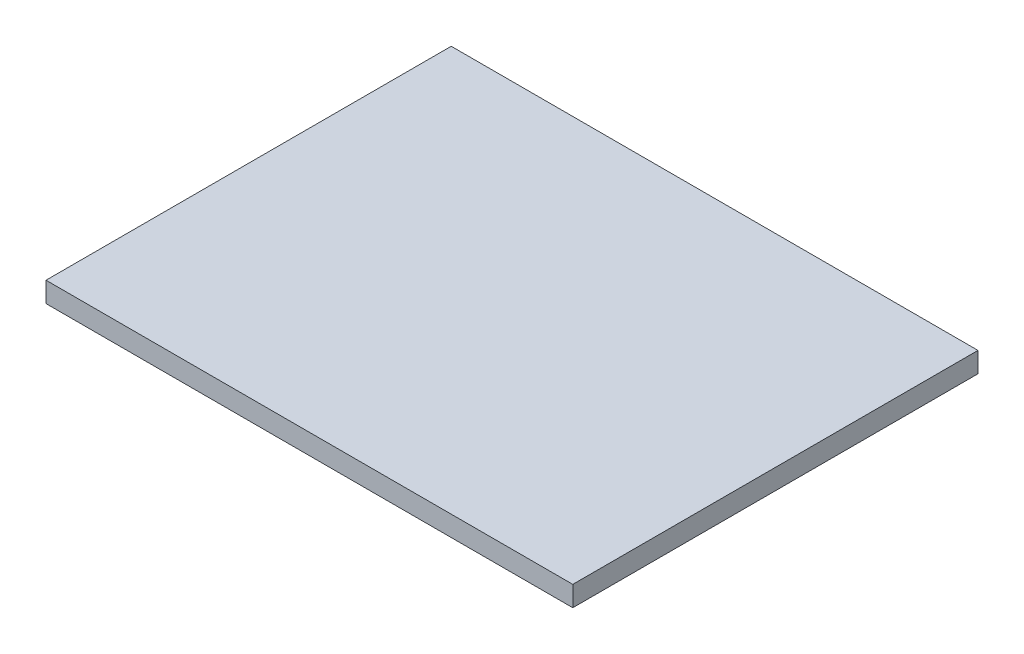
ISO-10303-21;
HEADER;
FILE_DESCRIPTION(('STEP AP214'),'2;1');
FILE_NAME('part.step','',(''),(''),'','','');
FILE_SCHEMA(('AUTOMOTIVE_DESIGN { 1 0 10303 214 1 1 1 1 }'));
ENDSEC;
DATA;
#1=APPLICATION_CONTEXT('core data for automotive mechanical design processes');
#2=APPLICATION_PROTOCOL_DEFINITION('international standard','automotive_design',2000,#1);
#3=PRODUCT_CONTEXT('',#1,'mechanical');
#4=PRODUCT('Part','Part','',(#3));
#5=PRODUCT_RELATED_PRODUCT_CATEGORY('part','',(#4));
#6=PRODUCT_DEFINITION_FORMATION('','',#4);
#7=PRODUCT_DEFINITION_CONTEXT('part definition',#1,'design');
#8=PRODUCT_DEFINITION('design','',#6,#7);
#9=PRODUCT_DEFINITION_SHAPE('','',#8);
#10=(LENGTH_UNIT() NAMED_UNIT(*) SI_UNIT(.MILLI.,.METRE.));
#11=(NAMED_UNIT(*) PLANE_ANGLE_UNIT() SI_UNIT($,.RADIAN.));
#12=(NAMED_UNIT(*) SI_UNIT($,.STERADIAN.) SOLID_ANGLE_UNIT());
#13=UNCERTAINTY_MEASURE_WITH_UNIT(LENGTH_MEASURE(1.E-05),#10,'distance_accuracy_value','');
#14=(GEOMETRIC_REPRESENTATION_CONTEXT(3) GLOBAL_UNCERTAINTY_ASSIGNED_CONTEXT((#13)) GLOBAL_UNIT_ASSIGNED_CONTEXT((#10,
#11,#12)) REPRESENTATION_CONTEXT('',''));
#15=CARTESIAN_POINT('',(0.,0.,0.));
#16=DIRECTION('',(0.,0.,1.));
#17=DIRECTION('',(1.,0.,0.));
#18=AXIS2_PLACEMENT_3D('',#15,#16,#17);
#19=CARTESIAN_POINT('',(60.,5.,45.));
#20=DIRECTION('',(-1.,0.,0.));
#21=DIRECTION('',(0.,0.,1.));
#22=AXIS2_PLACEMENT_3D('',#19,#20,#21);
#23=PLANE('',#22);
#24=DIRECTION('',(0.,0.,-1.));
#25=VECTOR('',#24,1.);
#26=CARTESIAN_POINT('',(60.,0.,45.));
#27=LINE('',#26,#25);
#28=CARTESIAN_POINT('',(60.,0.,45.));
#29=VERTEX_POINT('',#28);
#30=CARTESIAN_POINT('',(60.,0.,-45.));
#31=VERTEX_POINT('',#30);
#32=EDGE_CURVE('E131',#29,#31,#27,.T.);
#33=ORIENTED_EDGE('',*,*,#32,.T.);
#34=DIRECTION('',(0.,-1.,0.));
#35=VECTOR('',#34,1.);
#36=CARTESIAN_POINT('',(60.,5.,-45.));
#37=LINE('',#36,#35);
#38=CARTESIAN_POINT('',(60.,5.,-45.));
#39=VERTEX_POINT('',#38);
#40=EDGE_CURVE('E11',#39,#31,#37,.T.);
#41=ORIENTED_EDGE('',*,*,#40,.F.);
#42=DIRECTION('',(0.,0.,-1.));
#43=VECTOR('',#42,1.);
#44=CARTESIAN_POINT('',(60.,5.,45.));
#45=LINE('',#44,#43);
#46=CARTESIAN_POINT('',(60.,5.,45.));
#47=VERTEX_POINT('',#46);
#48=EDGE_CURVE('E140',#47,#39,#45,.T.);
#49=ORIENTED_EDGE('',*,*,#48,.F.);
#50=DIRECTION('',(0.,-1.,0.));
#51=VECTOR('',#50,1.);
#52=CARTESIAN_POINT('',(60.,5.,45.));
#53=LINE('',#52,#51);
#54=EDGE_CURVE('E149',#47,#29,#53,.T.);
#55=ORIENTED_EDGE('',*,*,#54,.T.);
#56=EDGE_LOOP('',(#33,#41,#49,#55));
#57=FACE_BOUND('',#56,.T.);
#58=ADVANCED_FACE('F33',(#57),#23,.F.);
#59=CARTESIAN_POINT('',(-60.,5.,-45.));
#60=DIRECTION('',(0.,0.,1.));
#61=DIRECTION('',(1.,0.,0.));
#62=AXIS2_PLACEMENT_3D('',#59,#60,#61);
#63=PLANE('',#62);
#64=DIRECTION('',(-1.,0.,0.));
#65=VECTOR('',#64,1.);
#66=CARTESIAN_POINT('',(-60.,0.,-45.));
#67=LINE('',#66,#65);
#68=CARTESIAN_POINT('',(-60.,0.,-45.));
#69=VERTEX_POINT('',#68);
#70=EDGE_CURVE('E134',#31,#69,#67,.T.);
#71=ORIENTED_EDGE('',*,*,#70,.T.);
#72=DIRECTION('',(0.,-1.,0.));
#73=VECTOR('',#72,1.);
#74=CARTESIAN_POINT('',(-60.,5.,-45.));
#75=LINE('',#74,#73);
#76=CARTESIAN_POINT('',(-60.,5.,-45.));
#77=VERTEX_POINT('',#76);
#78=EDGE_CURVE('E41',#77,#69,#75,.T.);
#79=ORIENTED_EDGE('',*,*,#78,.F.);
#80=DIRECTION('',(-1.,0.,0.));
#81=VECTOR('',#80,1.);
#82=CARTESIAN_POINT('',(-60.,5.,-45.));
#83=LINE('',#82,#81);
#84=EDGE_CURVE('E75',#39,#77,#83,.T.);
#85=ORIENTED_EDGE('',*,*,#84,.F.);
#86=ORIENTED_EDGE('',*,*,#40,.T.);
#87=EDGE_LOOP('',(#71,#79,#85,#86));
#88=FACE_BOUND('',#87,.T.);
#89=ADVANCED_FACE('F193',(#88),#63,.F.);
#90=CARTESIAN_POINT('',(-60.,5.,45.));
#91=DIRECTION('',(1.,0.,0.));
#92=DIRECTION('',(0.,0.,-1.));
#93=AXIS2_PLACEMENT_3D('',#90,#91,#92);
#94=PLANE('',#93);
#95=DIRECTION('',(0.,0.,1.));
#96=VECTOR('',#95,1.);
#97=CARTESIAN_POINT('',(-60.,0.,45.));
#98=LINE('',#97,#96);
#99=CARTESIAN_POINT('',(-60.,0.,45.));
#100=VERTEX_POINT('',#99);
#101=EDGE_CURVE('E65',#69,#100,#98,.T.);
#102=ORIENTED_EDGE('',*,*,#101,.T.);
#103=DIRECTION('',(0.,-1.,0.));
#104=VECTOR('',#103,1.);
#105=CARTESIAN_POINT('',(-60.,5.,45.));
#106=LINE('',#105,#104);
#107=CARTESIAN_POINT('',(-60.,5.,45.));
#108=VERTEX_POINT('',#107);
#109=EDGE_CURVE('E49',#108,#100,#106,.T.);
#110=ORIENTED_EDGE('',*,*,#109,.F.);
#111=DIRECTION('',(0.,0.,1.));
#112=VECTOR('',#111,1.);
#113=CARTESIAN_POINT('',(-60.,5.,45.));
#114=LINE('',#113,#112);
#115=EDGE_CURVE('E144',#77,#108,#114,.T.);
#116=ORIENTED_EDGE('',*,*,#115,.F.);
#117=ORIENTED_EDGE('',*,*,#78,.T.);
#118=EDGE_LOOP('',(#102,#110,#116,#117));
#119=FACE_BOUND('',#118,.T.);
#120=ADVANCED_FACE('F155',(#119),#94,.F.);
#121=CARTESIAN_POINT('',(-60.,5.,45.));
#122=DIRECTION('',(0.,0.,-1.));
#123=DIRECTION('',(-1.,0.,0.));
#124=AXIS2_PLACEMENT_3D('',#121,#122,#123);
#125=PLANE('',#124);
#126=DIRECTION('',(1.,0.,0.));
#127=VECTOR('',#126,1.);
#128=CARTESIAN_POINT('',(-60.,0.,45.));
#129=LINE('',#128,#127);
#130=EDGE_CURVE('E70',#100,#29,#129,.T.);
#131=ORIENTED_EDGE('',*,*,#130,.T.);
#132=ORIENTED_EDGE('',*,*,#54,.F.);
#133=DIRECTION('',(1.,0.,0.));
#134=VECTOR('',#133,1.);
#135=CARTESIAN_POINT('',(-60.,5.,45.));
#136=LINE('',#135,#134);
#137=EDGE_CURVE('E147',#108,#47,#136,.T.);
#138=ORIENTED_EDGE('',*,*,#137,.F.);
#139=ORIENTED_EDGE('',*,*,#109,.T.);
#140=EDGE_LOOP('',(#131,#132,#138,#139));
#141=FACE_BOUND('',#140,.T.);
#142=ADVANCED_FACE('F160',(#141),#125,.F.);
#143=CARTESIAN_POINT('',(0.,0.,0.));
#144=DIRECTION('',(0.,-1.,0.));
#145=DIRECTION('',(0.,0.,-1.));
#146=AXIS2_PLACEMENT_3D('',#143,#144,#145);
#147=PLANE('',#146);
#148=ORIENTED_EDGE('',*,*,#32,.F.);
#149=ORIENTED_EDGE('',*,*,#130,.F.);
#150=ORIENTED_EDGE('',*,*,#101,.F.);
#151=ORIENTED_EDGE('',*,*,#70,.F.);
#152=EDGE_LOOP('',(#148,#149,#150,#151));
#153=FACE_BOUND('',#152,.T.);
#154=ADVANCED_FACE('F158',(#153),#147,.T.);
#155=CARTESIAN_POINT('',(65.,10.,50.));
#156=DIRECTION('',(-1.,0.,0.));
#157=DIRECTION('',(0.,0.,1.));
#158=AXIS2_PLACEMENT_3D('',#155,#156,#157);
#159=PLANE('',#158);
#160=DIRECTION('',(0.,0.,-1.));
#161=VECTOR('',#160,1.);
#162=CARTESIAN_POINT('',(65.,5.,50.));
#163=LINE('',#162,#161);
#164=CARTESIAN_POINT('',(65.,5.,50.));
#165=VERTEX_POINT('',#164);
#166=CARTESIAN_POINT('',(65.,5.,-50.));
#167=VERTEX_POINT('',#166);
#168=EDGE_CURVE('E130',#165,#167,#163,.T.);
#169=ORIENTED_EDGE('',*,*,#168,.T.);
#170=DIRECTION('',(0.,-1.,0.));
#171=VECTOR('',#170,1.);
#172=CARTESIAN_POINT('',(65.,10.,-50.));
#173=LINE('',#172,#171);
#174=CARTESIAN_POINT('',(65.,10.,-50.));
#175=VERTEX_POINT('',#174);
#176=EDGE_CURVE('E110',#175,#167,#173,.T.);
#177=ORIENTED_EDGE('',*,*,#176,.F.);
#178=DIRECTION('',(0.,0.,-1.));
#179=VECTOR('',#178,1.);
#180=CARTESIAN_POINT('',(65.,10.,50.));
#181=LINE('',#180,#179);
#182=CARTESIAN_POINT('',(65.,10.,50.));
#183=VERTEX_POINT('',#182);
#184=EDGE_CURVE('E117',#183,#175,#181,.T.);
#185=ORIENTED_EDGE('',*,*,#184,.F.);
#186=DIRECTION('',(0.,-1.,0.));
#187=VECTOR('',#186,1.);
#188=CARTESIAN_POINT('',(65.,10.,50.));
#189=LINE('',#188,#187);
#190=EDGE_CURVE('E177',#183,#165,#189,.T.);
#191=ORIENTED_EDGE('',*,*,#190,.T.);
#192=EDGE_LOOP('',(#169,#177,#185,#191));
#193=FACE_BOUND('',#192,.T.);
#194=ADVANCED_FACE('F128',(#193),#159,.F.);
#195=CARTESIAN_POINT('',(-65.,10.,-50.));
#196=DIRECTION('',(0.,0.,1.));
#197=DIRECTION('',(1.,0.,0.));
#198=AXIS2_PLACEMENT_3D('',#195,#196,#197);
#199=PLANE('',#198);
#200=DIRECTION('',(-1.,0.,0.));
#201=VECTOR('',#200,1.);
#202=CARTESIAN_POINT('',(-65.,5.,-50.));
#203=LINE('',#202,#201);
#204=CARTESIAN_POINT('',(-65.,5.,-50.));
#205=VERTEX_POINT('',#204);
#206=EDGE_CURVE('E168',#167,#205,#203,.T.);
#207=ORIENTED_EDGE('',*,*,#206,.T.);
#208=DIRECTION('',(0.,-1.,0.));
#209=VECTOR('',#208,1.);
#210=CARTESIAN_POINT('',(-65.,10.,-50.));
#211=LINE('',#210,#209);
#212=CARTESIAN_POINT('',(-65.,10.,-50.));
#213=VERTEX_POINT('',#212);
#214=EDGE_CURVE('E113',#213,#205,#211,.T.);
#215=ORIENTED_EDGE('',*,*,#214,.F.);
#216=DIRECTION('',(-1.,0.,0.));
#217=VECTOR('',#216,1.);
#218=CARTESIAN_POINT('',(-65.,10.,-50.));
#219=LINE('',#218,#217);
#220=EDGE_CURVE('E106',#175,#213,#219,.T.);
#221=ORIENTED_EDGE('',*,*,#220,.F.);
#222=ORIENTED_EDGE('',*,*,#176,.T.);
#223=EDGE_LOOP('',(#207,#215,#221,#222));
#224=FACE_BOUND('',#223,.T.);
#225=ADVANCED_FACE('F108',(#224),#199,.F.);
#226=CARTESIAN_POINT('',(-65.,10.,50.));
#227=DIRECTION('',(1.,0.,0.));
#228=DIRECTION('',(0.,0.,-1.));
#229=AXIS2_PLACEMENT_3D('',#226,#227,#228);
#230=PLANE('',#229);
#231=DIRECTION('',(0.,0.,1.));
#232=VECTOR('',#231,1.);
#233=CARTESIAN_POINT('',(-65.,5.,50.));
#234=LINE('',#233,#232);
#235=CARTESIAN_POINT('',(-65.,5.,50.));
#236=VERTEX_POINT('',#235);
#237=EDGE_CURVE('E170',#205,#236,#234,.T.);
#238=ORIENTED_EDGE('',*,*,#237,.T.);
#239=DIRECTION('',(0.,-1.,0.));
#240=VECTOR('',#239,1.);
#241=CARTESIAN_POINT('',(-65.,10.,50.));
#242=LINE('',#241,#240);
#243=CARTESIAN_POINT('',(-65.,10.,50.));
#244=VERTEX_POINT('',#243);
#245=EDGE_CURVE('E136',#244,#236,#242,.T.);
#246=ORIENTED_EDGE('',*,*,#245,.F.);
#247=DIRECTION('',(0.,0.,1.));
#248=VECTOR('',#247,1.);
#249=CARTESIAN_POINT('',(-65.,10.,50.));
#250=LINE('',#249,#248);
#251=EDGE_CURVE('E116',#213,#244,#250,.T.);
#252=ORIENTED_EDGE('',*,*,#251,.F.);
#253=ORIENTED_EDGE('',*,*,#214,.T.);
#254=EDGE_LOOP('',(#238,#246,#252,#253));
#255=FACE_BOUND('',#254,.T.);
#256=ADVANCED_FACE('F183',(#255),#230,.F.);
#257=CARTESIAN_POINT('',(-65.,10.,50.));
#258=DIRECTION('',(0.,0.,-1.));
#259=DIRECTION('',(-1.,0.,0.));
#260=AXIS2_PLACEMENT_3D('',#257,#258,#259);
#261=PLANE('',#260);
#262=DIRECTION('',(1.,0.,0.));
#263=VECTOR('',#262,1.);
#264=CARTESIAN_POINT('',(-65.,5.,50.));
#265=LINE('',#264,#263);
#266=EDGE_CURVE('E126',#236,#165,#265,.T.);
#267=ORIENTED_EDGE('',*,*,#266,.T.);
#268=ORIENTED_EDGE('',*,*,#190,.F.);
#269=DIRECTION('',(1.,0.,0.));
#270=VECTOR('',#269,1.);
#271=CARTESIAN_POINT('',(-65.,10.,50.));
#272=LINE('',#271,#270);
#273=EDGE_CURVE('E122',#244,#183,#272,.T.);
#274=ORIENTED_EDGE('',*,*,#273,.F.);
#275=ORIENTED_EDGE('',*,*,#245,.T.);
#276=EDGE_LOOP('',(#267,#268,#274,#275));
#277=FACE_BOUND('',#276,.T.);
#278=ADVANCED_FACE('F181',(#277),#261,.F.);
#279=CARTESIAN_POINT('',(0.,10.,0.));
#280=DIRECTION('',(0.,-1.,0.));
#281=DIRECTION('',(0.,0.,-1.));
#282=AXIS2_PLACEMENT_3D('',#279,#280,#281);
#283=PLANE('',#282);
#284=ORIENTED_EDGE('',*,*,#184,.T.);
#285=ORIENTED_EDGE('',*,*,#220,.T.);
#286=ORIENTED_EDGE('',*,*,#251,.T.);
#287=ORIENTED_EDGE('',*,*,#273,.T.);
#288=EDGE_LOOP('',(#284,#285,#286,#287));
#289=FACE_BOUND('',#288,.T.);
#290=ADVANCED_FACE('F120',(#289),#283,.F.);
#291=CARTESIAN_POINT('',(0.,5.,0.));
#292=DIRECTION('',(0.,-1.,0.));
#293=DIRECTION('',(0.,0.,-1.));
#294=AXIS2_PLACEMENT_3D('',#291,#292,#293);
#295=PLANE('',#294);
#296=ORIENTED_EDGE('',*,*,#137,.T.);
#297=ORIENTED_EDGE('',*,*,#48,.T.);
#298=ORIENTED_EDGE('',*,*,#84,.T.);
#299=ORIENTED_EDGE('',*,*,#115,.T.);
#300=EDGE_LOOP('',(#296,#297,#298,#299));
#301=FACE_BOUND('',#300,.T.);
#302=ORIENTED_EDGE('',*,*,#168,.F.);
#303=ORIENTED_EDGE('',*,*,#266,.F.);
#304=ORIENTED_EDGE('',*,*,#237,.F.);
#305=ORIENTED_EDGE('',*,*,#206,.F.);
#306=EDGE_LOOP('',(#302,#303,#304,#305));
#307=FACE_BOUND('',#306,.T.);
#308=ADVANCED_FACE('F162',(#301,#307),#295,.T.);
#309=CLOSED_SHELL('',(#58,#89,#120,#142,#154,#194,#225,#256,#278,#290,#308));
#310=MANIFOLD_SOLID_BREP('B2',#309);
#311=ADVANCED_BREP_SHAPE_REPRESENTATION('',(#18,#310),#14);
#312=SHAPE_DEFINITION_REPRESENTATION(#9,#311);
ENDSEC;
END-ISO-10303-21;
